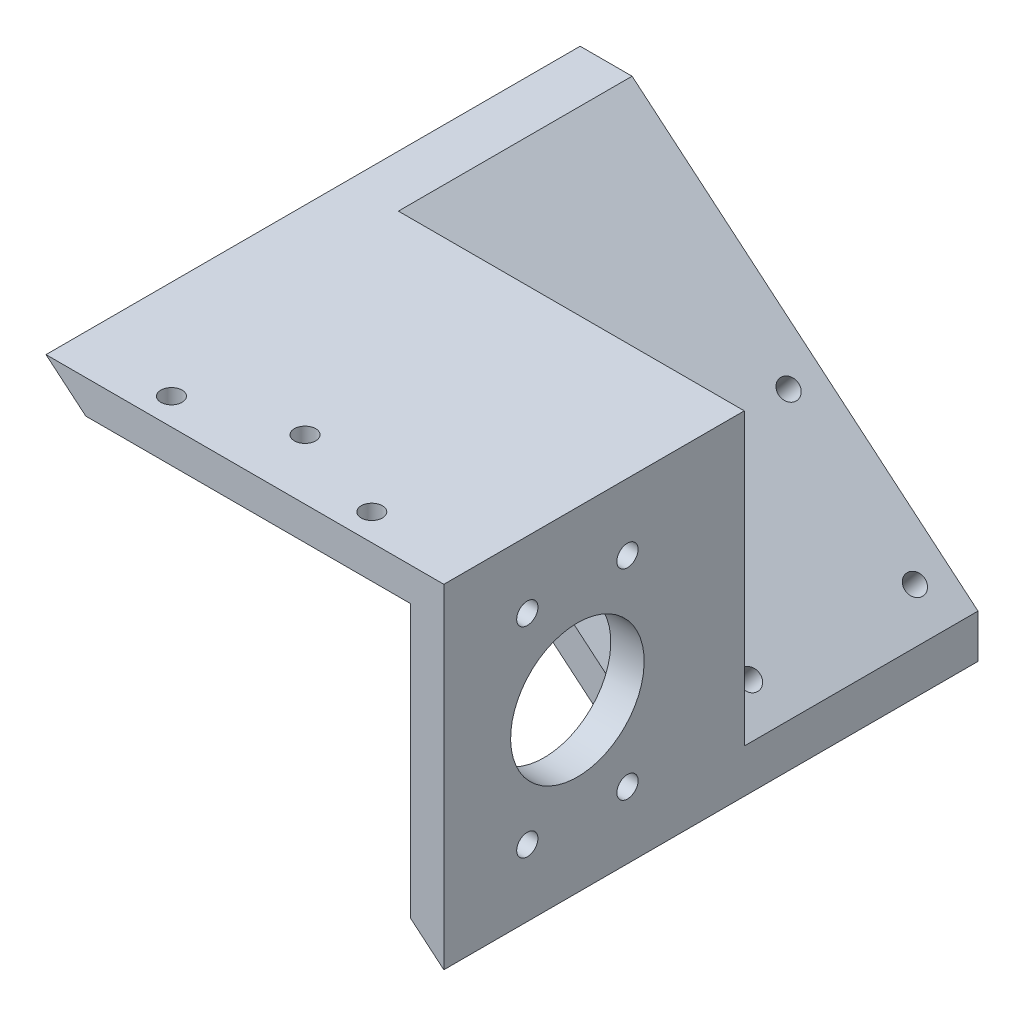
ISO-10303-21;
HEADER;
FILE_DESCRIPTION(('STEP AP214'),'2;1');
FILE_NAME('part.step','',(''),(''),'','','');
FILE_SCHEMA(('AUTOMOTIVE_DESIGN { 1 0 10303 214 1 1 1 1 }'));
ENDSEC;
DATA;
#1=APPLICATION_CONTEXT('core data for automotive mechanical design processes');
#2=APPLICATION_PROTOCOL_DEFINITION('international standard','automotive_design',2000,#1);
#3=PRODUCT_CONTEXT('',#1,'mechanical');
#4=PRODUCT('Part','Part','',(#3));
#5=PRODUCT_RELATED_PRODUCT_CATEGORY('part','',(#4));
#6=PRODUCT_DEFINITION_FORMATION('','',#4);
#7=PRODUCT_DEFINITION_CONTEXT('part definition',#1,'design');
#8=PRODUCT_DEFINITION('design','',#6,#7);
#9=PRODUCT_DEFINITION_SHAPE('','',#8);
#10=(LENGTH_UNIT() NAMED_UNIT(*) SI_UNIT(.MILLI.,.METRE.));
#11=(NAMED_UNIT(*) PLANE_ANGLE_UNIT() SI_UNIT($,.RADIAN.));
#12=(NAMED_UNIT(*) SI_UNIT($,.STERADIAN.) SOLID_ANGLE_UNIT());
#13=UNCERTAINTY_MEASURE_WITH_UNIT(LENGTH_MEASURE(1.E-05),#10,'distance_accuracy_value','');
#14=(GEOMETRIC_REPRESENTATION_CONTEXT(3) GLOBAL_UNCERTAINTY_ASSIGNED_CONTEXT((#13)) GLOBAL_UNIT_ASSIGNED_CONTEXT((#10,
#11,#12)) REPRESENTATION_CONTEXT('',''));
#15=CARTESIAN_POINT('',(0.,0.,0.));
#16=DIRECTION('',(0.,0.,1.));
#17=DIRECTION('',(1.,0.,0.));
#18=AXIS2_PLACEMENT_3D('',#15,#16,#17);
#19=CARTESIAN_POINT('',(0.,0.,101.6));
#20=DIRECTION('',(0.,-1.,0.));
#21=DIRECTION('',(0.,0.,-1.));
#22=AXIS2_PLACEMENT_3D('',#19,#20,#21);
#23=PLANE('',#22);
#24=CARTESIAN_POINT('',(56.8881765648666,0.,96.52));
#25=DIRECTION('',(0.,1.,0.));
#26=DIRECTION('',(0.,0.,1.));
#27=AXIS2_PLACEMENT_3D('',#24,#25,#26);
#28=CIRCLE('',#27,2.01929999999999);
#29=CARTESIAN_POINT('',(56.8881765648666,0.,98.5393));
#30=VERTEX_POINT('',#29);
#31=EDGE_CURVE('E145',#30,#30,#28,.T.);
#32=ORIENTED_EDGE('',*,*,#31,.F.);
#33=EDGE_LOOP('',(#32));
#34=FACE_BOUND('',#33,.T.);
#35=DIRECTION('',(1.,0.,0.));
#36=VECTOR('',#35,1.);
#37=CARTESIAN_POINT('',(9.87884630056372,0.,44.45));
#38=LINE('',#37,#36);
#39=CARTESIAN_POINT('',(9.87884630056372,0.,44.45));
#40=VERTEX_POINT('',#39);
#41=CARTESIAN_POINT('',(75.6763531297332,0.,44.45));
#42=VERTEX_POINT('',#41);
#43=EDGE_CURVE('E123',#40,#42,#38,.T.);
#44=ORIENTED_EDGE('',*,*,#43,.F.);
#45=DIRECTION('',(0.,0.,-1.));
#46=VECTOR('',#45,1.);
#47=CARTESIAN_POINT('',(9.87884630056372,0.,44.45));
#48=LINE('',#47,#46);
#49=CARTESIAN_POINT('',(9.87884630056372,0.,0.));
#50=VERTEX_POINT('',#49);
#51=EDGE_CURVE('E138',#40,#50,#48,.T.);
#52=ORIENTED_EDGE('',*,*,#51,.T.);
#53=DIRECTION('',(-1.,0.,0.));
#54=VECTOR('',#53,1.);
#55=CARTESIAN_POINT('',(0.,0.,0.));
#56=LINE('',#55,#54);
#57=CARTESIAN_POINT('',(0.,0.,0.));
#58=VERTEX_POINT('',#57);
#59=EDGE_CURVE('E232',#50,#58,#56,.T.);
#60=ORIENTED_EDGE('',*,*,#59,.T.);
#61=DIRECTION('',(0.,0.,-1.));
#62=VECTOR('',#61,1.);
#63=CARTESIAN_POINT('',(0.,0.,101.6));
#64=LINE('',#63,#62);
#65=CARTESIAN_POINT('',(0.,0.,101.6));
#66=VERTEX_POINT('',#65);
#67=EDGE_CURVE('E228',#66,#58,#64,.T.);
#68=ORIENTED_EDGE('',*,*,#67,.F.);
#69=DIRECTION('',(-1.,0.,0.));
#70=VECTOR('',#69,1.);
#71=CARTESIAN_POINT('',(0.,0.,101.6));
#72=LINE('',#71,#70);
#73=CARTESIAN_POINT('',(75.6763531297332,0.,101.6));
#74=VERTEX_POINT('',#73);
#75=EDGE_CURVE('E226',#74,#66,#72,.T.);
#76=ORIENTED_EDGE('',*,*,#75,.F.);
#77=DIRECTION('',(0.,0.,-1.));
#78=VECTOR('',#77,1.);
#79=CARTESIAN_POINT('',(75.6763531297332,0.,101.6));
#80=LINE('',#79,#78);
#81=EDGE_CURVE('E236',#74,#42,#80,.T.);
#82=ORIENTED_EDGE('',*,*,#81,.T.);
#83=EDGE_LOOP('',(#44,#52,#60,#68,#76,#82));
#84=FACE_BOUND('',#83,.T.);
#85=CARTESIAN_POINT('',(18.7881765648666,0.,96.52));
#86=DIRECTION('',(0.,1.,0.));
#87=DIRECTION('',(0.,0.,1.));
#88=AXIS2_PLACEMENT_3D('',#85,#86,#87);
#89=CIRCLE('',#88,2.01929999999999);
#90=CARTESIAN_POINT('',(18.7881765648666,0.,98.5393));
#91=VERTEX_POINT('',#90);
#92=EDGE_CURVE('E157',#91,#91,#89,.T.);
#93=ORIENTED_EDGE('',*,*,#92,.F.);
#94=EDGE_LOOP('',(#93));
#95=FACE_BOUND('',#94,.T.);
#96=CARTESIAN_POINT('',(37.8381765648666,0.,90.17));
#97=DIRECTION('',(0.,1.,0.));
#98=DIRECTION('',(0.,0.,1.));
#99=AXIS2_PLACEMENT_3D('',#96,#97,#98);
#100=CIRCLE('',#99,2.01929999999999);
#101=CARTESIAN_POINT('',(37.8381765648666,0.,92.1893));
#102=VERTEX_POINT('',#101);
#103=EDGE_CURVE('E151',#102,#102,#100,.T.);
#104=ORIENTED_EDGE('',*,*,#103,.F.);
#105=EDGE_LOOP('',(#104));
#106=FACE_BOUND('',#105,.T.);
#107=ADVANCED_FACE('F37',(#34,#84,#95,#106),#23,.F.);
#108=CARTESIAN_POINT('',(0.,0.,101.6));
#109=DIRECTION('',(0.,0.,1.));
#110=DIRECTION('',(1.,0.,0.));
#111=AXIS2_PLACEMENT_3D('',#108,#109,#110);
#112=PLANE('',#111);
#113=DIRECTION('',(0.,1.,0.));
#114=VECTOR('',#113,1.);
#115=CARTESIAN_POINT('',(69.3263531297332,-6.35,101.6));
#116=LINE('',#115,#114);
#117=CARTESIAN_POINT('',(69.3263531297332,-58.1717173420243,101.6));
#118=VERTEX_POINT('',#117);
#119=CARTESIAN_POINT('',(69.3263531297332,-6.35,101.6));
#120=VERTEX_POINT('',#119);
#121=EDGE_CURVE('E207',#118,#120,#116,.T.);
#122=ORIENTED_EDGE('',*,*,#121,.F.);
#123=DIRECTION('',(0.766044443118982,-0.642787609686535,0.));
#124=VECTOR('',#123,1.);
#125=CARTESIAN_POINT('',(75.6763531297332,-63.5,101.6));
#126=LINE('',#125,#124);
#127=CARTESIAN_POINT('',(75.6763531297332,-63.5,101.6));
#128=VERTEX_POINT('',#127);
#129=EDGE_CURVE('E224',#118,#128,#126,.T.);
#130=ORIENTED_EDGE('',*,*,#129,.T.);
#131=DIRECTION('',(0.,1.,0.));
#132=VECTOR('',#131,1.);
#133=CARTESIAN_POINT('',(75.6763531297332,0.,101.6));
#134=LINE('',#133,#132);
#135=EDGE_CURVE('E223',#128,#74,#134,.T.);
#136=ORIENTED_EDGE('',*,*,#135,.T.);
#137=ORIENTED_EDGE('',*,*,#75,.T.);
#138=CARTESIAN_POINT('',(7.56763531297332,-6.35,101.6));
#139=VERTEX_POINT('',#138);
#140=EDGE_CURVE('E220',#66,#139,#126,.T.);
#141=ORIENTED_EDGE('',*,*,#140,.T.);
#142=DIRECTION('',(-1.,0.,0.));
#143=VECTOR('',#142,1.);
#144=CARTESIAN_POINT('',(17.446481613537,-6.35,101.6));
#145=LINE('',#144,#143);
#146=EDGE_CURVE('E210',#120,#139,#145,.T.);
#147=ORIENTED_EDGE('',*,*,#146,.F.);
#148=EDGE_LOOP('',(#122,#130,#136,#137,#141,#147));
#149=FACE_BOUND('',#148,.T.);
#150=ADVANCED_FACE('F253',(#149),#112,.T.);
#151=CARTESIAN_POINT('',(0.,0.,0.));
#152=DIRECTION('',(0.,0.,1.));
#153=DIRECTION('',(1.,0.,0.));
#154=AXIS2_PLACEMENT_3D('',#151,#152,#153);
#155=PLANE('',#154);
#156=ORIENTED_EDGE('',*,*,#59,.F.);
#157=DIRECTION('',(0.766044443118982,-0.642787609686535,0.));
#158=VECTOR('',#157,1.);
#159=CARTESIAN_POINT('',(69.3263531297332,-49.8823810547644,0.));
#160=LINE('',#159,#158);
#161=CARTESIAN_POINT('',(75.6763531297332,-55.2106637127401,0.));
#162=VERTEX_POINT('',#161);
#163=EDGE_CURVE('E206',#50,#162,#160,.T.);
#164=ORIENTED_EDGE('',*,*,#163,.T.);
#165=DIRECTION('',(0.,1.,0.));
#166=VECTOR('',#165,1.);
#167=CARTESIAN_POINT('',(75.6763531297332,0.,0.));
#168=LINE('',#167,#166);
#169=CARTESIAN_POINT('',(75.6763531297332,-63.5,0.));
#170=VERTEX_POINT('',#169);
#171=EDGE_CURVE('E137',#170,#162,#168,.T.);
#172=ORIENTED_EDGE('',*,*,#171,.F.);
#173=DIRECTION('',(0.766044443118982,-0.642787609686535,0.));
#174=VECTOR('',#173,1.);
#175=CARTESIAN_POINT('',(75.6763531297332,-63.5,0.));
#176=LINE('',#175,#174);
#177=EDGE_CURVE('E219',#58,#170,#176,.T.);
#178=ORIENTED_EDGE('',*,*,#177,.F.);
#179=EDGE_LOOP('',(#156,#164,#172,#178));
#180=FACE_BOUND('',#179,.T.);
#181=ADVANCED_FACE('F246',(#180),#155,.F.);
#182=CARTESIAN_POINT('',(75.6763531297332,-63.5,101.6));
#183=DIRECTION('',(0.642787609686535,0.766044443118982,0.));
#184=DIRECTION('',(-0.766044443118982,0.642787609686535,0.));
#185=AXIS2_PLACEMENT_3D('',#182,#183,#184);
#186=PLANE('',#185);
#187=CARTESIAN_POINT('',(65.9475887021222,-55.336597356981,6.35000000000001));
#188=DIRECTION('',(-0.642787609686535,-0.766044443118982,0.));
#189=DIRECTION('',(0.766044443118982,-0.642787609686535,0.));
#190=AXIS2_PLACEMENT_3D('',#187,#188,#189);
#191=CIRCLE('',#190,1.90500000000001);
#192=CARTESIAN_POINT('',(67.4069033662638,-56.5611077534339,6.35000000000001));
#193=VERTEX_POINT('',#192);
#194=EDGE_CURVE('E282',#193,#193,#191,.T.);
#195=ORIENTED_EDGE('',*,*,#194,.F.);
#196=EDGE_LOOP('',(#195));
#197=FACE_BOUND('',#196,.T.);
#198=CARTESIAN_POINT('',(41.9175405659228,-35.1729928287241,6.35));
#199=DIRECTION('',(-0.642787609686535,-0.766044443118982,0.));
#200=DIRECTION('',(0.766044443118982,-0.642787609686535,0.));
#201=AXIS2_PLACEMENT_3D('',#198,#199,#200);
#202=CIRCLE('',#201,1.905);
#203=CARTESIAN_POINT('',(43.3768552300645,-36.3975032251769,6.35));
#204=VERTEX_POINT('',#203);
#205=EDGE_CURVE('E276',#204,#204,#202,.T.);
#206=ORIENTED_EDGE('',*,*,#205,.F.);
#207=EDGE_LOOP('',(#206));
#208=FACE_BOUND('',#207,.T.);
#209=CARTESIAN_POINT('',(65.9475887021222,-55.336597356981,37.719));
#210=DIRECTION('',(-0.642787609686535,-0.766044443118982,0.));
#211=DIRECTION('',(0.766044443118982,-0.642787609686535,0.));
#212=AXIS2_PLACEMENT_3D('',#209,#210,#211);
#213=CIRCLE('',#212,1.90500000000001);
#214=CARTESIAN_POINT('',(67.4069033662638,-56.5611077534339,37.719));
#215=VERTEX_POINT('',#214);
#216=EDGE_CURVE('E270',#215,#215,#213,.T.);
#217=ORIENTED_EDGE('',*,*,#216,.F.);
#218=EDGE_LOOP('',(#217));
#219=FACE_BOUND('',#218,.T.);
#220=CARTESIAN_POINT('',(41.9175405659228,-35.1729928287241,37.719));
#221=DIRECTION('',(-0.642787609686535,-0.766044443118982,0.));
#222=DIRECTION('',(0.766044443118982,-0.642787609686535,0.));
#223=AXIS2_PLACEMENT_3D('',#220,#221,#222);
#224=CIRCLE('',#223,1.90499999999999);
#225=CARTESIAN_POINT('',(43.3768552300645,-36.3975032251769,37.719));
#226=VERTEX_POINT('',#225);
#227=EDGE_CURVE('E133',#226,#226,#224,.T.);
#228=ORIENTED_EDGE('',*,*,#227,.F.);
#229=EDGE_LOOP('',(#228));
#230=FACE_BOUND('',#229,.T.);
#231=ORIENTED_EDGE('',*,*,#129,.F.);
#232=DIRECTION('',(0.,0.,-1.));
#233=VECTOR('',#232,1.);
#234=CARTESIAN_POINT('',(69.3263531297332,-58.1717173420243,101.6));
#235=LINE('',#234,#233);
#236=CARTESIAN_POINT('',(69.3263531297332,-58.1717173420243,57.15));
#237=VERTEX_POINT('',#236);
#238=EDGE_CURVE('E196',#118,#237,#235,.T.);
#239=ORIENTED_EDGE('',*,*,#238,.T.);
#240=DIRECTION('',(-0.766044443118982,0.642787609686535,0.));
#241=VECTOR('',#240,1.);
#242=CARTESIAN_POINT('',(75.6763531297332,-63.5,57.15));
#243=LINE('',#242,#241);
#244=CARTESIAN_POINT('',(7.56763531297332,-6.35,57.15));
#245=VERTEX_POINT('',#244);
#246=EDGE_CURVE('E201',#237,#245,#243,.T.);
#247=ORIENTED_EDGE('',*,*,#246,.T.);
#248=DIRECTION('',(0.,0.,-1.));
#249=VECTOR('',#248,1.);
#250=CARTESIAN_POINT('',(7.56763531297332,-6.35,101.6));
#251=LINE('',#250,#249);
#252=EDGE_CURVE('E204',#139,#245,#251,.T.);
#253=ORIENTED_EDGE('',*,*,#252,.F.);
#254=ORIENTED_EDGE('',*,*,#140,.F.);
#255=ORIENTED_EDGE('',*,*,#67,.T.);
#256=ORIENTED_EDGE('',*,*,#177,.T.);
#257=DIRECTION('',(0.,0.,-1.));
#258=VECTOR('',#257,1.);
#259=CARTESIAN_POINT('',(75.6763531297332,-63.5,101.6));
#260=LINE('',#259,#258);
#261=EDGE_CURVE('E45',#128,#170,#260,.T.);
#262=ORIENTED_EDGE('',*,*,#261,.F.);
#263=EDGE_LOOP('',(#231,#239,#247,#253,#254,#255,#256,#262));
#264=FACE_BOUND('',#263,.T.);
#265=ADVANCED_FACE('F39',(#197,#208,#219,#230,#264),#186,.F.);
#266=CARTESIAN_POINT('',(75.6763531297332,0.,101.6));
#267=DIRECTION('',(-1.,0.,0.));
#268=DIRECTION('',(0.,-1.,0.));
#269=AXIS2_PLACEMENT_3D('',#266,#267,#268);
#270=PLANE('',#269);
#271=CARTESIAN_POINT('',(75.6763531297332,-50.8,85.725));
#272=DIRECTION('',(1.,0.,0.));
#273=DIRECTION('',(0.,0.,-1.));
#274=AXIS2_PLACEMENT_3D('',#271,#272,#273);
#275=CIRCLE('',#274,2.01929999999999);
#276=CARTESIAN_POINT('',(75.6763531297332,-50.8,83.7057));
#277=VERTEX_POINT('',#276);
#278=EDGE_CURVE('E163',#277,#277,#275,.T.);
#279=ORIENTED_EDGE('',*,*,#278,.F.);
#280=EDGE_LOOP('',(#279));
#281=FACE_BOUND('',#280,.T.);
#282=CARTESIAN_POINT('',(75.6763531297332,-50.8,66.675));
#283=DIRECTION('',(1.,0.,0.));
#284=DIRECTION('',(0.,0.,-1.));
#285=AXIS2_PLACEMENT_3D('',#282,#283,#284);
#286=CIRCLE('',#285,2.01929999999999);
#287=CARTESIAN_POINT('',(75.6763531297332,-50.8,64.6557));
#288=VERTEX_POINT('',#287);
#289=EDGE_CURVE('E169',#288,#288,#286,.T.);
#290=ORIENTED_EDGE('',*,*,#289,.F.);
#291=EDGE_LOOP('',(#290));
#292=FACE_BOUND('',#291,.T.);
#293=CARTESIAN_POINT('',(75.6763531297332,-12.7,85.725));
#294=DIRECTION('',(1.,0.,0.));
#295=DIRECTION('',(0.,0.,-1.));
#296=AXIS2_PLACEMENT_3D('',#293,#294,#295);
#297=CIRCLE('',#296,2.01929999999999);
#298=CARTESIAN_POINT('',(75.6763531297332,-12.7,83.7057));
#299=VERTEX_POINT('',#298);
#300=EDGE_CURVE('E175',#299,#299,#297,.T.);
#301=ORIENTED_EDGE('',*,*,#300,.F.);
#302=EDGE_LOOP('',(#301));
#303=FACE_BOUND('',#302,.T.);
#304=CARTESIAN_POINT('',(75.6763531297332,-12.7,66.675));
#305=DIRECTION('',(1.,0.,0.));
#306=DIRECTION('',(0.,0.,-1.));
#307=AXIS2_PLACEMENT_3D('',#304,#305,#306);
#308=CIRCLE('',#307,2.01929999999999);
#309=CARTESIAN_POINT('',(75.6763531297332,-12.7,64.6557));
#310=VERTEX_POINT('',#309);
#311=EDGE_CURVE('E181',#310,#310,#308,.T.);
#312=ORIENTED_EDGE('',*,*,#311,.F.);
#313=EDGE_LOOP('',(#312));
#314=FACE_BOUND('',#313,.T.);
#315=CARTESIAN_POINT('',(75.6763531297332,-31.75,76.2));
#316=DIRECTION('',(1.,0.,0.));
#317=DIRECTION('',(0.,1.,0.));
#318=AXIS2_PLACEMENT_3D('',#315,#316,#317);
#319=CIRCLE('',#318,12.7);
#320=CARTESIAN_POINT('',(75.6763531297332,-19.05,76.2));
#321=VERTEX_POINT('',#320);
#322=EDGE_CURVE('E188',#321,#321,#319,.T.);
#323=ORIENTED_EDGE('',*,*,#322,.F.);
#324=EDGE_LOOP('',(#323));
#325=FACE_BOUND('',#324,.T.);
#326=ORIENTED_EDGE('',*,*,#171,.T.);
#327=DIRECTION('',(0.,0.,-1.));
#328=VECTOR('',#327,1.);
#329=CARTESIAN_POINT('',(75.6763531297332,-55.2106637127401,44.45));
#330=LINE('',#329,#328);
#331=CARTESIAN_POINT('',(75.6763531297332,-55.2106637127401,44.45));
#332=VERTEX_POINT('',#331);
#333=EDGE_CURVE('E118',#332,#162,#330,.T.);
#334=ORIENTED_EDGE('',*,*,#333,.F.);
#335=DIRECTION('',(0.,-1.,0.));
#336=VECTOR('',#335,1.);
#337=CARTESIAN_POINT('',(75.6763531297332,0.,44.45));
#338=LINE('',#337,#336);
#339=EDGE_CURVE('E127',#42,#332,#338,.T.);
#340=ORIENTED_EDGE('',*,*,#339,.F.);
#341=ORIENTED_EDGE('',*,*,#81,.F.);
#342=ORIENTED_EDGE('',*,*,#135,.F.);
#343=ORIENTED_EDGE('',*,*,#261,.T.);
#344=EDGE_LOOP('',(#326,#334,#340,#341,#342,#343));
#345=FACE_BOUND('',#344,.T.);
#346=ADVANCED_FACE('F135',(#281,#292,#303,#314,#325,#345),#270,.F.);
#347=CARTESIAN_POINT('',(69.3263531297332,-49.8823810547644,101.6));
#348=DIRECTION('',(0.642787609686535,0.766044443118982,0.));
#349=DIRECTION('',(-0.766044443118982,0.642787609686535,0.));
#350=AXIS2_PLACEMENT_3D('',#347,#348,#349);
#351=PLANE('',#350);
#352=CARTESIAN_POINT('',(70.0292900236317,-50.4722151431755,6.35000000000001));
#353=DIRECTION('',(0.642787609686535,0.766044443118982,0.));
#354=DIRECTION('',(-0.766044443118982,0.642787609686535,0.));
#355=AXIS2_PLACEMENT_3D('',#352,#353,#354);
#356=CIRCLE('',#355,1.90500000000001);
#357=CARTESIAN_POINT('',(68.56997535949,-49.2477047467226,6.35000000000001));
#358=VERTEX_POINT('',#357);
#359=EDGE_CURVE('E285',#358,#358,#356,.F.);
#360=ORIENTED_EDGE('',*,*,#359,.T.);
#361=EDGE_LOOP('',(#360));
#362=FACE_BOUND('',#361,.T.);
#363=CARTESIAN_POINT('',(45.9992418874323,-30.3086106149186,6.35));
#364=DIRECTION('',(0.642787609686535,0.766044443118982,0.));
#365=DIRECTION('',(-0.766044443118982,0.642787609686535,0.));
#366=AXIS2_PLACEMENT_3D('',#363,#364,#365);
#367=CIRCLE('',#366,1.905);
#368=CARTESIAN_POINT('',(44.5399272232907,-29.0841002184657,6.35));
#369=VERTEX_POINT('',#368);
#370=EDGE_CURVE('E279',#369,#369,#367,.F.);
#371=ORIENTED_EDGE('',*,*,#370,.T.);
#372=EDGE_LOOP('',(#371));
#373=FACE_BOUND('',#372,.T.);
#374=CARTESIAN_POINT('',(70.0292900236317,-50.4722151431755,37.719));
#375=DIRECTION('',(0.642787609686535,0.766044443118982,0.));
#376=DIRECTION('',(-0.766044443118982,0.642787609686535,0.));
#377=AXIS2_PLACEMENT_3D('',#374,#375,#376);
#378=CIRCLE('',#377,1.90500000000001);
#379=CARTESIAN_POINT('',(68.56997535949,-49.2477047467226,37.719));
#380=VERTEX_POINT('',#379);
#381=EDGE_CURVE('E273',#380,#380,#378,.F.);
#382=ORIENTED_EDGE('',*,*,#381,.T.);
#383=EDGE_LOOP('',(#382));
#384=FACE_BOUND('',#383,.T.);
#385=CARTESIAN_POINT('',(45.9992418874323,-30.3086106149186,37.719));
#386=DIRECTION('',(0.642787609686535,0.766044443118982,0.));
#387=DIRECTION('',(-0.766044443118982,0.642787609686535,0.));
#388=AXIS2_PLACEMENT_3D('',#385,#386,#387);
#389=CIRCLE('',#388,1.90499999999999);
#390=CARTESIAN_POINT('',(44.5399272232907,-29.0841002184657,37.719));
#391=VERTEX_POINT('',#390);
#392=EDGE_CURVE('E267',#391,#391,#389,.F.);
#393=ORIENTED_EDGE('',*,*,#392,.T.);
#394=EDGE_LOOP('',(#393));
#395=FACE_BOUND('',#394,.T.);
#396=DIRECTION('',(0.,0.,-1.));
#397=VECTOR('',#396,1.);
#398=CARTESIAN_POINT('',(69.3263531297332,-49.8823810547644,101.6));
#399=LINE('',#398,#397);
#400=CARTESIAN_POINT('',(69.3263531297332,-49.8823810547644,57.15));
#401=VERTEX_POINT('',#400);
#402=CARTESIAN_POINT('',(69.3263531297332,-49.8823810547644,44.45));
#403=VERTEX_POINT('',#402);
#404=EDGE_CURVE('E122',#401,#403,#399,.T.);
#405=ORIENTED_EDGE('',*,*,#404,.T.);
#406=DIRECTION('',(-0.766044443118982,0.642787609686535,0.));
#407=VECTOR('',#406,1.);
#408=CARTESIAN_POINT('',(75.6763531297332,-55.2106637127401,44.45));
#409=LINE('',#408,#407);
#410=EDGE_CURVE('E114',#332,#403,#409,.T.);
#411=ORIENTED_EDGE('',*,*,#410,.F.);
#412=ORIENTED_EDGE('',*,*,#333,.T.);
#413=ORIENTED_EDGE('',*,*,#163,.F.);
#414=ORIENTED_EDGE('',*,*,#51,.F.);
#415=CARTESIAN_POINT('',(17.446481613537,-6.35,44.45));
#416=VERTEX_POINT('',#415);
#417=EDGE_CURVE('E124',#416,#40,#409,.T.);
#418=ORIENTED_EDGE('',*,*,#417,.F.);
#419=DIRECTION('',(0.,0.,-1.));
#420=VECTOR('',#419,1.);
#421=CARTESIAN_POINT('',(17.446481613537,-6.35,101.6));
#422=LINE('',#421,#420);
#423=CARTESIAN_POINT('',(17.446481613537,-6.35,57.15));
#424=VERTEX_POINT('',#423);
#425=EDGE_CURVE('E212',#424,#416,#422,.T.);
#426=ORIENTED_EDGE('',*,*,#425,.F.);
#427=DIRECTION('',(-0.766044443118982,0.642787609686535,0.));
#428=VECTOR('',#427,1.);
#429=CARTESIAN_POINT('',(69.3263531297332,-49.8823810547644,57.15));
#430=LINE('',#429,#428);
#431=EDGE_CURVE('E199',#401,#424,#430,.T.);
#432=ORIENTED_EDGE('',*,*,#431,.F.);
#433=EDGE_LOOP('',(#405,#411,#412,#413,#414,#418,#426,#432));
#434=FACE_BOUND('',#433,.T.);
#435=ADVANCED_FACE('F116',(#362,#373,#384,#395,#434),#351,.T.);
#436=CARTESIAN_POINT('',(69.3263531297332,-6.35,101.6));
#437=DIRECTION('',(-1.,0.,0.));
#438=DIRECTION('',(0.,0.,1.));
#439=AXIS2_PLACEMENT_3D('',#436,#437,#438);
#440=PLANE('',#439);
#441=DIRECTION('',(0.,1.,0.));
#442=VECTOR('',#441,1.);
#443=CARTESIAN_POINT('',(69.3263531297332,-6.35,44.45));
#444=LINE('',#443,#442);
#445=CARTESIAN_POINT('',(69.3263531297332,-6.35,44.45));
#446=VERTEX_POINT('',#445);
#447=EDGE_CURVE('E51',#403,#446,#444,.T.);
#448=ORIENTED_EDGE('',*,*,#447,.F.);
#449=ORIENTED_EDGE('',*,*,#404,.F.);
#450=DIRECTION('',(0.,1.,0.));
#451=VECTOR('',#450,1.);
#452=CARTESIAN_POINT('',(69.3263531297332,-63.5,57.15));
#453=LINE('',#452,#451);
#454=EDGE_CURVE('E194',#237,#401,#453,.T.);
#455=ORIENTED_EDGE('',*,*,#454,.F.);
#456=ORIENTED_EDGE('',*,*,#238,.F.);
#457=ORIENTED_EDGE('',*,*,#121,.T.);
#458=DIRECTION('',(0.,0.,-1.));
#459=VECTOR('',#458,1.);
#460=CARTESIAN_POINT('',(69.3263531297332,-6.35,101.6));
#461=LINE('',#460,#459);
#462=EDGE_CURVE('E215',#120,#446,#461,.T.);
#463=ORIENTED_EDGE('',*,*,#462,.T.);
#464=EDGE_LOOP('',(#448,#449,#455,#456,#457,#463));
#465=FACE_BOUND('',#464,.T.);
#466=CARTESIAN_POINT('',(69.3263531297332,-50.8,85.725));
#467=DIRECTION('',(-1.,0.,0.));
#468=DIRECTION('',(0.,0.,1.));
#469=AXIS2_PLACEMENT_3D('',#466,#467,#468);
#470=CIRCLE('',#469,2.01929999999999);
#471=CARTESIAN_POINT('',(69.3263531297332,-50.8,87.7443));
#472=VERTEX_POINT('',#471);
#473=EDGE_CURVE('E166',#472,#472,#470,.T.);
#474=ORIENTED_EDGE('',*,*,#473,.F.);
#475=EDGE_LOOP('',(#474));
#476=FACE_BOUND('',#475,.T.);
#477=CARTESIAN_POINT('',(69.3263531297332,-50.8,66.675));
#478=DIRECTION('',(-1.,0.,0.));
#479=DIRECTION('',(0.,0.,1.));
#480=AXIS2_PLACEMENT_3D('',#477,#478,#479);
#481=CIRCLE('',#480,2.01929999999999);
#482=CARTESIAN_POINT('',(69.3263531297332,-50.8,68.6943));
#483=VERTEX_POINT('',#482);
#484=EDGE_CURVE('E172',#483,#483,#481,.T.);
#485=ORIENTED_EDGE('',*,*,#484,.F.);
#486=EDGE_LOOP('',(#485));
#487=FACE_BOUND('',#486,.T.);
#488=CARTESIAN_POINT('',(69.3263531297332,-12.7,85.725));
#489=DIRECTION('',(-1.,0.,0.));
#490=DIRECTION('',(0.,0.,1.));
#491=AXIS2_PLACEMENT_3D('',#488,#489,#490);
#492=CIRCLE('',#491,2.01929999999999);
#493=CARTESIAN_POINT('',(69.3263531297332,-12.7,87.7443));
#494=VERTEX_POINT('',#493);
#495=EDGE_CURVE('E178',#494,#494,#492,.T.);
#496=ORIENTED_EDGE('',*,*,#495,.F.);
#497=EDGE_LOOP('',(#496));
#498=FACE_BOUND('',#497,.T.);
#499=CARTESIAN_POINT('',(69.3263531297332,-12.7,66.675));
#500=DIRECTION('',(-1.,0.,0.));
#501=DIRECTION('',(0.,0.,1.));
#502=AXIS2_PLACEMENT_3D('',#499,#500,#501);
#503=CIRCLE('',#502,2.01929999999999);
#504=CARTESIAN_POINT('',(69.3263531297332,-12.7,68.6943));
#505=VERTEX_POINT('',#504);
#506=EDGE_CURVE('E184',#505,#505,#503,.T.);
#507=ORIENTED_EDGE('',*,*,#506,.F.);
#508=EDGE_LOOP('',(#507));
#509=FACE_BOUND('',#508,.T.);
#510=CARTESIAN_POINT('',(69.3263531297332,-31.75,76.2));
#511=DIRECTION('',(-1.,0.,0.));
#512=DIRECTION('',(0.,0.,1.));
#513=AXIS2_PLACEMENT_3D('',#510,#511,#512);
#514=CIRCLE('',#513,12.7);
#515=CARTESIAN_POINT('',(69.3263531297332,-31.75,88.9));
#516=VERTEX_POINT('',#515);
#517=EDGE_CURVE('E187',#516,#516,#514,.F.);
#518=ORIENTED_EDGE('',*,*,#517,.T.);
#519=EDGE_LOOP('',(#518));
#520=FACE_BOUND('',#519,.T.);
#521=ADVANCED_FACE('F259',(#465,#476,#487,#498,#509,#520),#440,.T.);
#522=CARTESIAN_POINT('',(17.446481613537,-6.35,101.6));
#523=DIRECTION('',(0.,-1.,0.));
#524=DIRECTION('',(1.,0.,0.));
#525=AXIS2_PLACEMENT_3D('',#522,#523,#524);
#526=PLANE('',#525);
#527=DIRECTION('',(-1.,0.,0.));
#528=VECTOR('',#527,1.);
#529=CARTESIAN_POINT('',(17.446481613537,-6.35,44.45));
#530=LINE('',#529,#528);
#531=EDGE_CURVE('E11',#446,#416,#530,.T.);
#532=ORIENTED_EDGE('',*,*,#531,.F.);
#533=ORIENTED_EDGE('',*,*,#462,.F.);
#534=ORIENTED_EDGE('',*,*,#146,.T.);
#535=ORIENTED_EDGE('',*,*,#252,.T.);
#536=DIRECTION('',(-1.,0.,0.));
#537=VECTOR('',#536,1.);
#538=CARTESIAN_POINT('',(0.,-6.35,57.15));
#539=LINE('',#538,#537);
#540=EDGE_CURVE('E59',#424,#245,#539,.T.);
#541=ORIENTED_EDGE('',*,*,#540,.F.);
#542=ORIENTED_EDGE('',*,*,#425,.T.);
#543=EDGE_LOOP('',(#532,#533,#534,#535,#541,#542));
#544=FACE_BOUND('',#543,.T.);
#545=CARTESIAN_POINT('',(56.8881765648666,-6.35,96.52));
#546=DIRECTION('',(0.,-1.,0.));
#547=DIRECTION('',(1.,0.,0.));
#548=AXIS2_PLACEMENT_3D('',#545,#546,#547);
#549=CIRCLE('',#548,2.01929999999999);
#550=CARTESIAN_POINT('',(58.9074765648666,-6.35,96.52));
#551=VERTEX_POINT('',#550);
#552=EDGE_CURVE('E148',#551,#551,#549,.T.);
#553=ORIENTED_EDGE('',*,*,#552,.F.);
#554=EDGE_LOOP('',(#553));
#555=FACE_BOUND('',#554,.T.);
#556=CARTESIAN_POINT('',(37.8381765648666,-6.35,90.17));
#557=DIRECTION('',(0.,-1.,0.));
#558=DIRECTION('',(1.,0.,0.));
#559=AXIS2_PLACEMENT_3D('',#556,#557,#558);
#560=CIRCLE('',#559,2.01929999999999);
#561=CARTESIAN_POINT('',(39.8574765648666,-6.35,90.17));
#562=VERTEX_POINT('',#561);
#563=EDGE_CURVE('E154',#562,#562,#560,.T.);
#564=ORIENTED_EDGE('',*,*,#563,.F.);
#565=EDGE_LOOP('',(#564));
#566=FACE_BOUND('',#565,.T.);
#567=CARTESIAN_POINT('',(18.7881765648666,-6.35,96.52));
#568=DIRECTION('',(0.,-1.,0.));
#569=DIRECTION('',(1.,0.,0.));
#570=AXIS2_PLACEMENT_3D('',#567,#568,#569);
#571=CIRCLE('',#570,2.01929999999999);
#572=CARTESIAN_POINT('',(20.8074765648666,-6.35,96.52));
#573=VERTEX_POINT('',#572);
#574=EDGE_CURVE('E160',#573,#573,#571,.T.);
#575=ORIENTED_EDGE('',*,*,#574,.F.);
#576=EDGE_LOOP('',(#575));
#577=FACE_BOUND('',#576,.T.);
#578=ADVANCED_FACE('F264',(#544,#555,#566,#577),#526,.T.);
#579=CARTESIAN_POINT('',(0.,-63.5,57.15));
#580=DIRECTION('',(0.,0.,-1.));
#581=DIRECTION('',(-1.,0.,0.));
#582=AXIS2_PLACEMENT_3D('',#579,#580,#581);
#583=PLANE('',#582);
#584=ORIENTED_EDGE('',*,*,#454,.T.);
#585=ORIENTED_EDGE('',*,*,#431,.T.);
#586=ORIENTED_EDGE('',*,*,#540,.T.);
#587=ORIENTED_EDGE('',*,*,#246,.F.);
#588=EDGE_LOOP('',(#584,#585,#586,#587));
#589=FACE_BOUND('',#588,.T.);
#590=ADVANCED_FACE('F262',(#589),#583,.F.);
#591=CARTESIAN_POINT('',(-0.00100000000001488,-31.75,76.2));
#592=DIRECTION('',(1.,0.,0.));
#593=DIRECTION('',(0.,1.,0.));
#594=AXIS2_PLACEMENT_3D('',#591,#592,#593);
#595=CYLINDRICAL_SURFACE('',#594,12.7);
#596=ORIENTED_EDGE('',*,*,#517,.F.);
#597=EDGE_LOOP('',(#596));
#598=FACE_BOUND('',#597,.T.);
#599=ORIENTED_EDGE('',*,*,#322,.T.);
#600=EDGE_LOOP('',(#599));
#601=FACE_BOUND('',#600,.T.);
#602=ADVANCED_FACE('F342',(#598,#601),#595,.F.);
#603=CARTESIAN_POINT('',(75.6763531297332,-12.7,66.675));
#604=DIRECTION('',(1.,0.,0.));
#605=DIRECTION('',(0.,0.,-1.));
#606=AXIS2_PLACEMENT_3D('',#603,#604,#605);
#607=CYLINDRICAL_SURFACE('',#606,2.01929999999999);
#608=ORIENTED_EDGE('',*,*,#311,.T.);
#609=EDGE_LOOP('',(#608));
#610=FACE_BOUND('',#609,.T.);
#611=ORIENTED_EDGE('',*,*,#506,.T.);
#612=EDGE_LOOP('',(#611));
#613=FACE_BOUND('',#612,.T.);
#614=ADVANCED_FACE('F344',(#610,#613),#607,.F.);
#615=CARTESIAN_POINT('',(75.6763531297332,-12.7,85.725));
#616=DIRECTION('',(1.,0.,0.));
#617=DIRECTION('',(0.,0.,-1.));
#618=AXIS2_PLACEMENT_3D('',#615,#616,#617);
#619=CYLINDRICAL_SURFACE('',#618,2.01929999999999);
#620=ORIENTED_EDGE('',*,*,#300,.T.);
#621=EDGE_LOOP('',(#620));
#622=FACE_BOUND('',#621,.T.);
#623=ORIENTED_EDGE('',*,*,#495,.T.);
#624=EDGE_LOOP('',(#623));
#625=FACE_BOUND('',#624,.T.);
#626=ADVANCED_FACE('F351',(#622,#625),#619,.F.);
#627=CARTESIAN_POINT('',(75.6763531297332,-50.8,66.675));
#628=DIRECTION('',(1.,0.,0.));
#629=DIRECTION('',(0.,0.,-1.));
#630=AXIS2_PLACEMENT_3D('',#627,#628,#629);
#631=CYLINDRICAL_SURFACE('',#630,2.01929999999999);
#632=ORIENTED_EDGE('',*,*,#289,.T.);
#633=EDGE_LOOP('',(#632));
#634=FACE_BOUND('',#633,.T.);
#635=ORIENTED_EDGE('',*,*,#484,.T.);
#636=EDGE_LOOP('',(#635));
#637=FACE_BOUND('',#636,.T.);
#638=ADVANCED_FACE('F399',(#634,#637),#631,.F.);
#639=CARTESIAN_POINT('',(75.6763531297332,-50.8,85.725));
#640=DIRECTION('',(1.,0.,0.));
#641=DIRECTION('',(0.,0.,-1.));
#642=AXIS2_PLACEMENT_3D('',#639,#640,#641);
#643=CYLINDRICAL_SURFACE('',#642,2.01929999999999);
#644=ORIENTED_EDGE('',*,*,#278,.T.);
#645=EDGE_LOOP('',(#644));
#646=FACE_BOUND('',#645,.T.);
#647=ORIENTED_EDGE('',*,*,#473,.T.);
#648=EDGE_LOOP('',(#647));
#649=FACE_BOUND('',#648,.T.);
#650=ADVANCED_FACE('F409',(#646,#649),#643,.F.);
#651=CARTESIAN_POINT('',(18.7881765648666,0.,96.52));
#652=DIRECTION('',(0.,1.,0.));
#653=DIRECTION('',(0.,0.,1.));
#654=AXIS2_PLACEMENT_3D('',#651,#652,#653);
#655=CYLINDRICAL_SURFACE('',#654,2.01929999999999);
#656=ORIENTED_EDGE('',*,*,#92,.T.);
#657=EDGE_LOOP('',(#656));
#658=FACE_BOUND('',#657,.T.);
#659=ORIENTED_EDGE('',*,*,#574,.T.);
#660=EDGE_LOOP('',(#659));
#661=FACE_BOUND('',#660,.T.);
#662=ADVANCED_FACE('F420',(#658,#661),#655,.F.);
#663=CARTESIAN_POINT('',(37.8381765648666,0.,90.17));
#664=DIRECTION('',(0.,1.,0.));
#665=DIRECTION('',(0.,0.,1.));
#666=AXIS2_PLACEMENT_3D('',#663,#664,#665);
#667=CYLINDRICAL_SURFACE('',#666,2.01929999999999);
#668=ORIENTED_EDGE('',*,*,#103,.T.);
#669=EDGE_LOOP('',(#668));
#670=FACE_BOUND('',#669,.T.);
#671=ORIENTED_EDGE('',*,*,#563,.T.);
#672=EDGE_LOOP('',(#671));
#673=FACE_BOUND('',#672,.T.);
#674=ADVANCED_FACE('F432',(#670,#673),#667,.F.);
#675=CARTESIAN_POINT('',(56.8881765648666,0.,96.52));
#676=DIRECTION('',(0.,1.,0.));
#677=DIRECTION('',(0.,0.,1.));
#678=AXIS2_PLACEMENT_3D('',#675,#676,#677);
#679=CYLINDRICAL_SURFACE('',#678,2.01929999999999);
#680=ORIENTED_EDGE('',*,*,#31,.T.);
#681=EDGE_LOOP('',(#680));
#682=FACE_BOUND('',#681,.T.);
#683=ORIENTED_EDGE('',*,*,#552,.T.);
#684=EDGE_LOOP('',(#683));
#685=FACE_BOUND('',#684,.T.);
#686=ADVANCED_FACE('F313',(#682,#685),#679,.F.);
#687=CARTESIAN_POINT('',(0.,0.,44.45));
#688=DIRECTION('',(0.,0.,1.));
#689=DIRECTION('',(1.,0.,0.));
#690=AXIS2_PLACEMENT_3D('',#687,#688,#689);
#691=PLANE('',#690);
#692=ORIENTED_EDGE('',*,*,#447,.T.);
#693=ORIENTED_EDGE('',*,*,#531,.T.);
#694=ORIENTED_EDGE('',*,*,#417,.T.);
#695=ORIENTED_EDGE('',*,*,#43,.T.);
#696=ORIENTED_EDGE('',*,*,#339,.T.);
#697=ORIENTED_EDGE('',*,*,#410,.T.);
#698=EDGE_LOOP('',(#692,#693,#694,#695,#696,#697));
#699=FACE_BOUND('',#698,.T.);
#700=ADVANCED_FACE('F128',(#699),#691,.F.);
#701=CARTESIAN_POINT('',(73.186092303848,2.09141604016665,37.719));
#702=DIRECTION('',(-0.642787609686535,-0.766044443118982,0.));
#703=DIRECTION('',(0.766044443118982,-0.642787609686535,0.));
#704=AXIS2_PLACEMENT_3D('',#701,#702,#703);
#705=CYLINDRICAL_SURFACE('',#704,1.90499999999999);
#706=ORIENTED_EDGE('',*,*,#392,.F.);
#707=EDGE_LOOP('',(#706));
#708=FACE_BOUND('',#707,.T.);
#709=ORIENTED_EDGE('',*,*,#227,.T.);
#710=EDGE_LOOP('',(#709));
#711=FACE_BOUND('',#710,.T.);
#712=ADVANCED_FACE('F301',(#708,#711),#705,.F.);
#713=CARTESIAN_POINT('',(97.2161404400474,-18.0721884880903,37.719));
#714=DIRECTION('',(-0.642787609686535,-0.766044443118982,0.));
#715=DIRECTION('',(0.766044443118982,-0.642787609686535,0.));
#716=AXIS2_PLACEMENT_3D('',#713,#714,#715);
#717=CYLINDRICAL_SURFACE('',#716,1.90500000000001);
#718=ORIENTED_EDGE('',*,*,#381,.F.);
#719=EDGE_LOOP('',(#718));
#720=FACE_BOUND('',#719,.T.);
#721=ORIENTED_EDGE('',*,*,#216,.T.);
#722=EDGE_LOOP('',(#721));
#723=FACE_BOUND('',#722,.T.);
#724=ADVANCED_FACE('F303',(#720,#723),#717,.F.);
#725=CARTESIAN_POINT('',(73.186092303848,2.09141604016664,6.35));
#726=DIRECTION('',(-0.642787609686535,-0.766044443118982,0.));
#727=DIRECTION('',(0.766044443118982,-0.642787609686535,0.));
#728=AXIS2_PLACEMENT_3D('',#725,#726,#727);
#729=CYLINDRICAL_SURFACE('',#728,1.905);
#730=ORIENTED_EDGE('',*,*,#370,.F.);
#731=EDGE_LOOP('',(#730));
#732=FACE_BOUND('',#731,.T.);
#733=ORIENTED_EDGE('',*,*,#205,.T.);
#734=EDGE_LOOP('',(#733));
#735=FACE_BOUND('',#734,.T.);
#736=ADVANCED_FACE('F310',(#732,#735),#729,.F.);
#737=CARTESIAN_POINT('',(97.2161404400474,-18.0721884880903,6.35000000000001));
#738=DIRECTION('',(-0.642787609686535,-0.766044443118982,0.));
#739=DIRECTION('',(0.766044443118982,-0.642787609686535,0.));
#740=AXIS2_PLACEMENT_3D('',#737,#738,#739);
#741=CYLINDRICAL_SURFACE('',#740,1.90500000000001);
#742=ORIENTED_EDGE('',*,*,#359,.F.);
#743=EDGE_LOOP('',(#742));
#744=FACE_BOUND('',#743,.T.);
#745=ORIENTED_EDGE('',*,*,#194,.T.);
#746=EDGE_LOOP('',(#745));
#747=FACE_BOUND('',#746,.T.);
#748=ADVANCED_FACE('F291',(#744,#747),#741,.F.);
#749=CLOSED_SHELL('',(#107,#150,#181,#265,#346,#435,#521,#578,#590,#602,#614,#626,#638,#650,
#662,#674,#686,#700,#712,#724,#736,#748));
#750=MANIFOLD_SOLID_BREP('B2',#749);
#751=ADVANCED_BREP_SHAPE_REPRESENTATION('',(#18,#750),#14);
#752=SHAPE_DEFINITION_REPRESENTATION(#9,#751);
ENDSEC;
END-ISO-10303-21;
